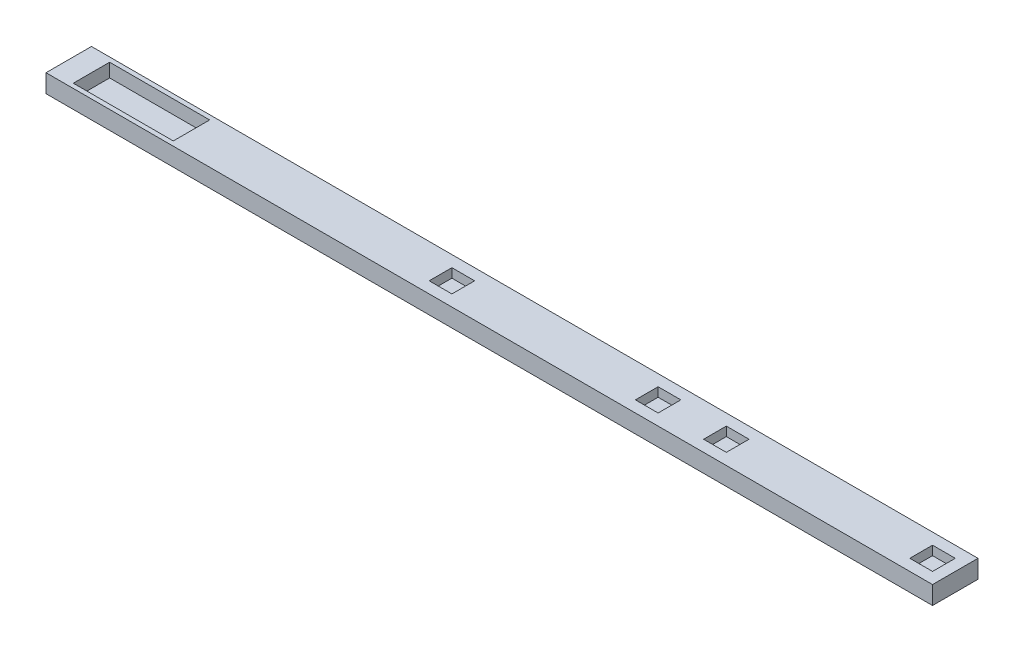
ISO-10303-21;
HEADER;
FILE_DESCRIPTION(('STEP AP214'),'2;1');
FILE_NAME('part.step','',(''),(''),'','','');
FILE_SCHEMA(('AUTOMOTIVE_DESIGN { 1 0 10303 214 1 1 1 1 }'));
ENDSEC;
DATA;
#1=APPLICATION_CONTEXT('core data for automotive mechanical design processes');
#2=APPLICATION_PROTOCOL_DEFINITION('international standard','automotive_design',2000,#1);
#3=PRODUCT_CONTEXT('',#1,'mechanical');
#4=PRODUCT('Part','Part','',(#3));
#5=PRODUCT_RELATED_PRODUCT_CATEGORY('part','',(#4));
#6=PRODUCT_DEFINITION_FORMATION('','',#4);
#7=PRODUCT_DEFINITION_CONTEXT('part definition',#1,'design');
#8=PRODUCT_DEFINITION('design','',#6,#7);
#9=PRODUCT_DEFINITION_SHAPE('','',#8);
#10=(LENGTH_UNIT() NAMED_UNIT(*) SI_UNIT(.MILLI.,.METRE.));
#11=(NAMED_UNIT(*) PLANE_ANGLE_UNIT() SI_UNIT($,.RADIAN.));
#12=(NAMED_UNIT(*) SI_UNIT($,.STERADIAN.) SOLID_ANGLE_UNIT());
#13=UNCERTAINTY_MEASURE_WITH_UNIT(LENGTH_MEASURE(1.E-05),#10,'distance_accuracy_value','');
#14=(GEOMETRIC_REPRESENTATION_CONTEXT(3) GLOBAL_UNCERTAINTY_ASSIGNED_CONTEXT((#13)) GLOBAL_UNIT_ASSIGNED_CONTEXT((#10,
#11,#12)) REPRESENTATION_CONTEXT('',''));
#15=CARTESIAN_POINT('',(0.,0.,0.));
#16=DIRECTION('',(0.,0.,1.));
#17=DIRECTION('',(1.,0.,0.));
#18=AXIS2_PLACEMENT_3D('',#15,#16,#17);
#19=CARTESIAN_POINT('',(97.5,4.,5.00000000000001));
#20=DIRECTION('',(-1.,0.,0.));
#21=DIRECTION('',(0.,0.,1.));
#22=AXIS2_PLACEMENT_3D('',#19,#20,#21);
#23=PLANE('',#22);
#24=DIRECTION('',(0.,0.,-1.));
#25=VECTOR('',#24,1.);
#26=CARTESIAN_POINT('',(97.5,0.,5.00000000000001));
#27=LINE('',#26,#25);
#28=CARTESIAN_POINT('',(97.5,0.,5.00000000000001));
#29=VERTEX_POINT('',#28);
#30=CARTESIAN_POINT('',(97.5,0.,-4.99999999999999));
#31=VERTEX_POINT('',#30);
#32=EDGE_CURVE('E357',#29,#31,#27,.T.);
#33=ORIENTED_EDGE('',*,*,#32,.T.);
#34=DIRECTION('',(0.,-1.,0.));
#35=VECTOR('',#34,1.);
#36=CARTESIAN_POINT('',(97.5,4.,-4.99999999999999));
#37=LINE('',#36,#35);
#38=CARTESIAN_POINT('',(97.5,4.,-4.99999999999999));
#39=VERTEX_POINT('',#38);
#40=EDGE_CURVE('E11',#39,#31,#37,.T.);
#41=ORIENTED_EDGE('',*,*,#40,.F.);
#42=DIRECTION('',(0.,0.,-1.));
#43=VECTOR('',#42,1.);
#44=CARTESIAN_POINT('',(97.5,4.,5.00000000000001));
#45=LINE('',#44,#43);
#46=CARTESIAN_POINT('',(97.5,4.,5.00000000000001));
#47=VERTEX_POINT('',#46);
#48=EDGE_CURVE('E364',#47,#39,#45,.T.);
#49=ORIENTED_EDGE('',*,*,#48,.F.);
#50=DIRECTION('',(0.,-1.,0.));
#51=VECTOR('',#50,1.);
#52=CARTESIAN_POINT('',(97.5,4.,5.00000000000001));
#53=LINE('',#52,#51);
#54=EDGE_CURVE('E374',#47,#29,#53,.T.);
#55=ORIENTED_EDGE('',*,*,#54,.T.);
#56=EDGE_LOOP('',(#33,#41,#49,#55));
#57=FACE_BOUND('',#56,.T.);
#58=ADVANCED_FACE('F39',(#57),#23,.F.);
#59=CARTESIAN_POINT('',(-97.5,4.,-5.00000000000001));
#60=DIRECTION('',(0.,0.,1.));
#61=DIRECTION('',(1.,0.,0.));
#62=AXIS2_PLACEMENT_3D('',#59,#60,#61);
#63=PLANE('',#62);
#64=DIRECTION('',(-1.,0.,0.));
#65=VECTOR('',#64,1.);
#66=CARTESIAN_POINT('',(-97.5,0.,-5.00000000000001));
#67=LINE('',#66,#65);
#68=CARTESIAN_POINT('',(-97.5,0.,-5.00000000000001));
#69=VERTEX_POINT('',#68);
#70=EDGE_CURVE('E377',#31,#69,#67,.T.);
#71=ORIENTED_EDGE('',*,*,#70,.T.);
#72=DIRECTION('',(0.,-1.,0.));
#73=VECTOR('',#72,1.);
#74=CARTESIAN_POINT('',(-97.5,4.,-5.00000000000001));
#75=LINE('',#74,#73);
#76=CARTESIAN_POINT('',(-97.5,4.,-5.00000000000001));
#77=VERTEX_POINT('',#76);
#78=EDGE_CURVE('E46',#77,#69,#75,.T.);
#79=ORIENTED_EDGE('',*,*,#78,.F.);
#80=DIRECTION('',(-1.,0.,0.));
#81=VECTOR('',#80,1.);
#82=CARTESIAN_POINT('',(-97.5,4.,-5.00000000000001));
#83=LINE('',#82,#81);
#84=EDGE_CURVE('E367',#39,#77,#83,.T.);
#85=ORIENTED_EDGE('',*,*,#84,.F.);
#86=ORIENTED_EDGE('',*,*,#40,.T.);
#87=EDGE_LOOP('',(#71,#79,#85,#86));
#88=FACE_BOUND('',#87,.T.);
#89=ADVANCED_FACE('F407',(#88),#63,.F.);
#90=CARTESIAN_POINT('',(-97.5,4.,5.00000000000001));
#91=DIRECTION('',(1.,0.,0.));
#92=DIRECTION('',(0.,0.,-1.));
#93=AXIS2_PLACEMENT_3D('',#90,#91,#92);
#94=PLANE('',#93);
#95=DIRECTION('',(0.,0.,1.));
#96=VECTOR('',#95,1.);
#97=CARTESIAN_POINT('',(-97.5,0.,5.00000000000001));
#98=LINE('',#97,#96);
#99=CARTESIAN_POINT('',(-97.5,0.,5.00000000000001));
#100=VERTEX_POINT('',#99);
#101=EDGE_CURVE('E379',#69,#100,#98,.T.);
#102=ORIENTED_EDGE('',*,*,#101,.T.);
#103=DIRECTION('',(0.,-1.,0.));
#104=VECTOR('',#103,1.);
#105=CARTESIAN_POINT('',(-97.5,4.,5.00000000000001));
#106=LINE('',#105,#104);
#107=CARTESIAN_POINT('',(-97.5,4.,5.00000000000001));
#108=VERTEX_POINT('',#107);
#109=EDGE_CURVE('E384',#108,#100,#106,.T.);
#110=ORIENTED_EDGE('',*,*,#109,.F.);
#111=DIRECTION('',(0.,0.,1.));
#112=VECTOR('',#111,1.);
#113=CARTESIAN_POINT('',(-97.5,4.,5.00000000000001));
#114=LINE('',#113,#112);
#115=EDGE_CURVE('E370',#77,#108,#114,.T.);
#116=ORIENTED_EDGE('',*,*,#115,.F.);
#117=ORIENTED_EDGE('',*,*,#78,.T.);
#118=EDGE_LOOP('',(#102,#110,#116,#117));
#119=FACE_BOUND('',#118,.T.);
#120=ADVANCED_FACE('F391',(#119),#94,.F.);
#121=CARTESIAN_POINT('',(-97.5,4.,5.00000000000001));
#122=DIRECTION('',(0.,0.,-1.));
#123=DIRECTION('',(-1.,0.,0.));
#124=AXIS2_PLACEMENT_3D('',#121,#122,#123);
#125=PLANE('',#124);
#126=DIRECTION('',(1.,0.,0.));
#127=VECTOR('',#126,1.);
#128=CARTESIAN_POINT('',(-97.5,0.,5.00000000000001));
#129=LINE('',#128,#127);
#130=EDGE_CURVE('E368',#100,#29,#129,.T.);
#131=ORIENTED_EDGE('',*,*,#130,.T.);
#132=ORIENTED_EDGE('',*,*,#54,.F.);
#133=DIRECTION('',(1.,0.,0.));
#134=VECTOR('',#133,1.);
#135=CARTESIAN_POINT('',(-97.5,4.,5.00000000000001));
#136=LINE('',#135,#134);
#137=EDGE_CURVE('E372',#108,#47,#136,.T.);
#138=ORIENTED_EDGE('',*,*,#137,.F.);
#139=ORIENTED_EDGE('',*,*,#109,.T.);
#140=EDGE_LOOP('',(#131,#132,#138,#139));
#141=FACE_BOUND('',#140,.T.);
#142=ADVANCED_FACE('F400',(#141),#125,.F.);
#143=CARTESIAN_POINT('',(0.,4.,0.));
#144=DIRECTION('',(0.,-1.,0.));
#145=DIRECTION('',(0.,0.,-1.));
#146=AXIS2_PLACEMENT_3D('',#143,#144,#145);
#147=PLANE('',#146);
#148=DIRECTION('',(-1.,0.,0.));
#149=VECTOR('',#148,1.);
#150=CARTESIAN_POINT('',(90.,4.,-2.5));
#151=LINE('',#150,#149);
#152=CARTESIAN_POINT('',(95.,4.,-2.5));
#153=VERTEX_POINT('',#152);
#154=CARTESIAN_POINT('',(90.,4.,-2.5));
#155=VERTEX_POINT('',#154);
#156=EDGE_CURVE('E228',#153,#155,#151,.T.);
#157=ORIENTED_EDGE('',*,*,#156,.F.);
#158=DIRECTION('',(0.,0.,-1.));
#159=VECTOR('',#158,1.);
#160=CARTESIAN_POINT('',(95.,4.,2.5));
#161=LINE('',#160,#159);
#162=CARTESIAN_POINT('',(95.,4.,2.5));
#163=VERTEX_POINT('',#162);
#164=EDGE_CURVE('E53',#163,#153,#161,.T.);
#165=ORIENTED_EDGE('',*,*,#164,.F.);
#166=DIRECTION('',(1.,0.,0.));
#167=VECTOR('',#166,1.);
#168=CARTESIAN_POINT('',(90.,4.,2.5));
#169=LINE('',#168,#167);
#170=CARTESIAN_POINT('',(90.,4.,2.5));
#171=VERTEX_POINT('',#170);
#172=EDGE_CURVE('E219',#171,#163,#169,.T.);
#173=ORIENTED_EDGE('',*,*,#172,.F.);
#174=DIRECTION('',(0.,0.,1.));
#175=VECTOR('',#174,1.);
#176=CARTESIAN_POINT('',(90.,4.,2.5));
#177=LINE('',#176,#175);
#178=EDGE_CURVE('E222',#155,#171,#177,.T.);
#179=ORIENTED_EDGE('',*,*,#178,.F.);
#180=EDGE_LOOP('',(#157,#165,#173,#179));
#181=FACE_BOUND('',#180,.T.);
#182=DIRECTION('',(0.,0.,-1.));
#183=VECTOR('',#182,1.);
#184=CARTESIAN_POINT('',(34.64,4.,2.50000000000001));
#185=LINE('',#184,#183);
#186=CARTESIAN_POINT('',(34.64,4.,2.50000000000001));
#187=VERTEX_POINT('',#186);
#188=CARTESIAN_POINT('',(34.64,4.,-2.5));
#189=VERTEX_POINT('',#188);
#190=EDGE_CURVE('E255',#187,#189,#185,.T.);
#191=ORIENTED_EDGE('',*,*,#190,.F.);
#192=DIRECTION('',(1.,0.,0.));
#193=VECTOR('',#192,1.);
#194=CARTESIAN_POINT('',(34.64,4.,2.50000000000001));
#195=LINE('',#194,#193);
#196=CARTESIAN_POINT('',(29.64,4.,2.50000000000001));
#197=VERTEX_POINT('',#196);
#198=EDGE_CURVE('E61',#197,#187,#195,.T.);
#199=ORIENTED_EDGE('',*,*,#198,.F.);
#200=DIRECTION('',(0.,0.,1.));
#201=VECTOR('',#200,1.);
#202=CARTESIAN_POINT('',(29.64,4.,2.50000000000001));
#203=LINE('',#202,#201);
#204=CARTESIAN_POINT('',(29.64,4.,-2.5));
#205=VERTEX_POINT('',#204);
#206=EDGE_CURVE('E248',#205,#197,#203,.T.);
#207=ORIENTED_EDGE('',*,*,#206,.F.);
#208=DIRECTION('',(-1.,0.,0.));
#209=VECTOR('',#208,1.);
#210=CARTESIAN_POINT('',(34.64,4.,-2.5));
#211=LINE('',#210,#209);
#212=EDGE_CURVE('E251',#189,#205,#211,.T.);
#213=ORIENTED_EDGE('',*,*,#212,.F.);
#214=EDGE_LOOP('',(#191,#199,#207,#213));
#215=FACE_BOUND('',#214,.T.);
#216=DIRECTION('',(0.,0.,-1.));
#217=VECTOR('',#216,1.);
#218=CARTESIAN_POINT('',(-10.72,4.,2.5));
#219=LINE('',#218,#217);
#220=CARTESIAN_POINT('',(-10.72,4.,2.5));
#221=VERTEX_POINT('',#220);
#222=CARTESIAN_POINT('',(-10.72,4.,-2.5));
#223=VERTEX_POINT('',#222);
#224=EDGE_CURVE('E318',#221,#223,#219,.T.);
#225=ORIENTED_EDGE('',*,*,#224,.F.);
#226=DIRECTION('',(1.,0.,0.));
#227=VECTOR('',#226,1.);
#228=CARTESIAN_POINT('',(-10.72,4.,2.5));
#229=LINE('',#228,#227);
#230=CARTESIAN_POINT('',(-15.72,4.,2.5));
#231=VERTEX_POINT('',#230);
#232=EDGE_CURVE('E280',#231,#221,#229,.T.);
#233=ORIENTED_EDGE('',*,*,#232,.F.);
#234=DIRECTION('',(0.,0.,1.));
#235=VECTOR('',#234,1.);
#236=CARTESIAN_POINT('',(-15.72,4.,2.5));
#237=LINE('',#236,#235);
#238=CARTESIAN_POINT('',(-15.72,4.,-2.5));
#239=VERTEX_POINT('',#238);
#240=EDGE_CURVE('E311',#239,#231,#237,.T.);
#241=ORIENTED_EDGE('',*,*,#240,.F.);
#242=DIRECTION('',(-1.,0.,0.));
#243=VECTOR('',#242,1.);
#244=CARTESIAN_POINT('',(-10.72,4.,-2.5));
#245=LINE('',#244,#243);
#246=EDGE_CURVE('E314',#223,#239,#245,.T.);
#247=ORIENTED_EDGE('',*,*,#246,.F.);
#248=EDGE_LOOP('',(#225,#233,#241,#247));
#249=FACE_BOUND('',#248,.T.);
#250=DIRECTION('',(-1.,0.,0.));
#251=VECTOR('',#250,1.);
#252=CARTESIAN_POINT('',(44.64,4.,-2.5));
#253=LINE('',#252,#251);
#254=CARTESIAN_POINT('',(49.64,4.,-2.5));
#255=VERTEX_POINT('',#254);
#256=CARTESIAN_POINT('',(44.64,4.,-2.5));
#257=VERTEX_POINT('',#256);
#258=EDGE_CURVE('E288',#255,#257,#253,.T.);
#259=ORIENTED_EDGE('',*,*,#258,.F.);
#260=DIRECTION('',(0.,0.,-1.));
#261=VECTOR('',#260,1.);
#262=CARTESIAN_POINT('',(49.64,4.,2.50000000000001));
#263=LINE('',#262,#261);
#264=CARTESIAN_POINT('',(49.64,4.,2.50000000000001));
#265=VERTEX_POINT('',#264);
#266=EDGE_CURVE('E229',#265,#255,#263,.T.);
#267=ORIENTED_EDGE('',*,*,#266,.F.);
#268=DIRECTION('',(1.,0.,0.));
#269=VECTOR('',#268,1.);
#270=CARTESIAN_POINT('',(44.64,4.,2.50000000000001));
#271=LINE('',#270,#269);
#272=CARTESIAN_POINT('',(44.64,4.,2.50000000000001));
#273=VERTEX_POINT('',#272);
#274=EDGE_CURVE('E281',#273,#265,#271,.T.);
#275=ORIENTED_EDGE('',*,*,#274,.F.);
#276=DIRECTION('',(0.,0.,1.));
#277=VECTOR('',#276,1.);
#278=CARTESIAN_POINT('',(44.64,4.,2.50000000000001));
#279=LINE('',#278,#277);
#280=EDGE_CURVE('E284',#257,#273,#279,.T.);
#281=ORIENTED_EDGE('',*,*,#280,.F.);
#282=EDGE_LOOP('',(#259,#267,#275,#281));
#283=FACE_BOUND('',#282,.T.);
#284=DIRECTION('',(0.,0.,-1.));
#285=VECTOR('',#284,1.);
#286=CARTESIAN_POINT('',(-70.5,4.,3.99999999999999));
#287=LINE('',#286,#285);
#288=CARTESIAN_POINT('',(-70.5,4.,3.99999999999999));
#289=VERTEX_POINT('',#288);
#290=CARTESIAN_POINT('',(-70.5,4.,-4.00000000000001));
#291=VERTEX_POINT('',#290);
#292=EDGE_CURVE('E347',#289,#291,#287,.T.);
#293=ORIENTED_EDGE('',*,*,#292,.F.);
#294=DIRECTION('',(1.,0.,0.));
#295=VECTOR('',#294,1.);
#296=CARTESIAN_POINT('',(-92.5,4.,4.00000000000001));
#297=LINE('',#296,#295);
#298=CARTESIAN_POINT('',(-92.5,4.,4.00000000000001));
#299=VERTEX_POINT('',#298);
#300=EDGE_CURVE('E235',#299,#289,#297,.T.);
#301=ORIENTED_EDGE('',*,*,#300,.F.);
#302=DIRECTION('',(0.,0.,1.));
#303=VECTOR('',#302,1.);
#304=CARTESIAN_POINT('',(-92.5,4.,4.00000000000001));
#305=LINE('',#304,#303);
#306=CARTESIAN_POINT('',(-92.5,4.,-3.99999999999999));
#307=VERTEX_POINT('',#306);
#308=EDGE_CURVE('E336',#307,#299,#305,.T.);
#309=ORIENTED_EDGE('',*,*,#308,.F.);
#310=DIRECTION('',(-1.,0.,0.));
#311=VECTOR('',#310,1.);
#312=CARTESIAN_POINT('',(-92.5,4.,-3.99999999999999));
#313=LINE('',#312,#311);
#314=EDGE_CURVE('E350',#291,#307,#313,.T.);
#315=ORIENTED_EDGE('',*,*,#314,.F.);
#316=EDGE_LOOP('',(#293,#301,#309,#315));
#317=FACE_BOUND('',#316,.T.);
#318=ORIENTED_EDGE('',*,*,#48,.T.);
#319=ORIENTED_EDGE('',*,*,#84,.T.);
#320=ORIENTED_EDGE('',*,*,#115,.T.);
#321=ORIENTED_EDGE('',*,*,#137,.T.);
#322=EDGE_LOOP('',(#318,#319,#320,#321));
#323=FACE_BOUND('',#322,.T.);
#324=ADVANCED_FACE('F406',(#181,#215,#249,#283,#317,#323),#147,.F.);
#325=CARTESIAN_POINT('',(0.,0.,0.));
#326=DIRECTION('',(0.,-1.,0.));
#327=DIRECTION('',(0.,0.,-1.));
#328=AXIS2_PLACEMENT_3D('',#325,#326,#327);
#329=PLANE('',#328);
#330=ORIENTED_EDGE('',*,*,#32,.F.);
#331=ORIENTED_EDGE('',*,*,#130,.F.);
#332=ORIENTED_EDGE('',*,*,#101,.F.);
#333=ORIENTED_EDGE('',*,*,#70,.F.);
#334=EDGE_LOOP('',(#330,#331,#332,#333));
#335=FACE_BOUND('',#334,.T.);
#336=ADVANCED_FACE('F397',(#335),#329,.T.);
#337=CARTESIAN_POINT('',(-92.5,1.,4.00000000000001));
#338=DIRECTION('',(0.,0.,1.));
#339=DIRECTION('',(1.,0.,0.));
#340=AXIS2_PLACEMENT_3D('',#337,#338,#339);
#341=PLANE('',#340);
#342=ORIENTED_EDGE('',*,*,#300,.T.);
#343=DIRECTION('',(0.,1.,0.));
#344=VECTOR('',#343,1.);
#345=CARTESIAN_POINT('',(-70.5,1.,3.99999999999999));
#346=LINE('',#345,#344);
#347=CARTESIAN_POINT('',(-70.5,1.,3.99999999999999));
#348=VERTEX_POINT('',#347);
#349=EDGE_CURVE('E345',#348,#289,#346,.T.);
#350=ORIENTED_EDGE('',*,*,#349,.F.);
#351=DIRECTION('',(1.,0.,0.));
#352=VECTOR('',#351,1.);
#353=CARTESIAN_POINT('',(-92.5,1.,4.00000000000001));
#354=LINE('',#353,#352);
#355=CARTESIAN_POINT('',(-92.5,1.,4.00000000000001));
#356=VERTEX_POINT('',#355);
#357=EDGE_CURVE('E332',#356,#348,#354,.T.);
#358=ORIENTED_EDGE('',*,*,#357,.F.);
#359=DIRECTION('',(0.,1.,0.));
#360=VECTOR('',#359,1.);
#361=CARTESIAN_POINT('',(-92.5,1.,4.00000000000001));
#362=LINE('',#361,#360);
#363=EDGE_CURVE('E355',#356,#299,#362,.T.);
#364=ORIENTED_EDGE('',*,*,#363,.T.);
#365=EDGE_LOOP('',(#342,#350,#358,#364));
#366=FACE_BOUND('',#365,.T.);
#367=ADVANCED_FACE('F419',(#366),#341,.F.);
#368=CARTESIAN_POINT('',(-92.5,1.,4.00000000000001));
#369=DIRECTION('',(-1.,0.,0.));
#370=DIRECTION('',(0.,0.,1.));
#371=AXIS2_PLACEMENT_3D('',#368,#369,#370);
#372=PLANE('',#371);
#373=ORIENTED_EDGE('',*,*,#308,.T.);
#374=ORIENTED_EDGE('',*,*,#363,.F.);
#375=DIRECTION('',(0.,0.,1.));
#376=VECTOR('',#375,1.);
#377=CARTESIAN_POINT('',(-92.5,1.,4.00000000000001));
#378=LINE('',#377,#376);
#379=CARTESIAN_POINT('',(-92.5,1.,-3.99999999999999));
#380=VERTEX_POINT('',#379);
#381=EDGE_CURVE('E342',#380,#356,#378,.T.);
#382=ORIENTED_EDGE('',*,*,#381,.F.);
#383=DIRECTION('',(0.,1.,0.));
#384=VECTOR('',#383,1.);
#385=CARTESIAN_POINT('',(-92.5,1.,-3.99999999999999));
#386=LINE('',#385,#384);
#387=EDGE_CURVE('E358',#380,#307,#386,.T.);
#388=ORIENTED_EDGE('',*,*,#387,.T.);
#389=EDGE_LOOP('',(#373,#374,#382,#388));
#390=FACE_BOUND('',#389,.T.);
#391=ADVANCED_FACE('F425',(#390),#372,.F.);
#392=CARTESIAN_POINT('',(-92.5,1.,-3.99999999999999));
#393=DIRECTION('',(0.,0.,-1.));
#394=DIRECTION('',(-1.,0.,0.));
#395=AXIS2_PLACEMENT_3D('',#392,#393,#394);
#396=PLANE('',#395);
#397=ORIENTED_EDGE('',*,*,#314,.T.);
#398=ORIENTED_EDGE('',*,*,#387,.F.);
#399=DIRECTION('',(-1.,0.,0.));
#400=VECTOR('',#399,1.);
#401=CARTESIAN_POINT('',(-92.5,1.,-3.99999999999999));
#402=LINE('',#401,#400);
#403=CARTESIAN_POINT('',(-70.5,1.,-4.00000000000001));
#404=VERTEX_POINT('',#403);
#405=EDGE_CURVE('E339',#404,#380,#402,.T.);
#406=ORIENTED_EDGE('',*,*,#405,.F.);
#407=DIRECTION('',(0.,1.,0.));
#408=VECTOR('',#407,1.);
#409=CARTESIAN_POINT('',(-70.5,1.,-4.00000000000001));
#410=LINE('',#409,#408);
#411=EDGE_CURVE('E360',#404,#291,#410,.T.);
#412=ORIENTED_EDGE('',*,*,#411,.T.);
#413=EDGE_LOOP('',(#397,#398,#406,#412));
#414=FACE_BOUND('',#413,.T.);
#415=ADVANCED_FACE('F431',(#414),#396,.F.);
#416=CARTESIAN_POINT('',(-70.5,1.,3.99999999999999));
#417=DIRECTION('',(1.,0.,0.));
#418=DIRECTION('',(0.,0.,-1.));
#419=AXIS2_PLACEMENT_3D('',#416,#417,#418);
#420=PLANE('',#419);
#421=ORIENTED_EDGE('',*,*,#292,.T.);
#422=ORIENTED_EDGE('',*,*,#411,.F.);
#423=DIRECTION('',(0.,0.,-1.));
#424=VECTOR('',#423,1.);
#425=CARTESIAN_POINT('',(-70.5,1.,3.99999999999999));
#426=LINE('',#425,#424);
#427=EDGE_CURVE('E335',#348,#404,#426,.T.);
#428=ORIENTED_EDGE('',*,*,#427,.F.);
#429=ORIENTED_EDGE('',*,*,#349,.T.);
#430=EDGE_LOOP('',(#421,#422,#428,#429));
#431=FACE_BOUND('',#430,.T.);
#432=ADVANCED_FACE('F427',(#431),#420,.F.);
#433=CARTESIAN_POINT('',(0.,1.,0.));
#434=DIRECTION('',(0.,1.,0.));
#435=DIRECTION('',(0.,0.,1.));
#436=AXIS2_PLACEMENT_3D('',#433,#434,#435);
#437=PLANE('',#436);
#438=ORIENTED_EDGE('',*,*,#357,.T.);
#439=ORIENTED_EDGE('',*,*,#427,.T.);
#440=ORIENTED_EDGE('',*,*,#405,.T.);
#441=ORIENTED_EDGE('',*,*,#381,.T.);
#442=EDGE_LOOP('',(#438,#439,#440,#441));
#443=FACE_BOUND('',#442,.T.);
#444=ADVANCED_FACE('F430',(#443),#437,.T.);
#445=CARTESIAN_POINT('',(49.64,2.,2.50000000000001));
#446=DIRECTION('',(1.,0.,0.));
#447=DIRECTION('',(0.,0.,-1.));
#448=AXIS2_PLACEMENT_3D('',#445,#446,#447);
#449=PLANE('',#448);
#450=ORIENTED_EDGE('',*,*,#266,.T.);
#451=DIRECTION('',(0.,1.,0.));
#452=VECTOR('',#451,1.);
#453=CARTESIAN_POINT('',(49.64,2.,-2.5));
#454=LINE('',#453,#452);
#455=CARTESIAN_POINT('',(49.64,2.,-2.5));
#456=VERTEX_POINT('',#455);
#457=EDGE_CURVE('E270',#456,#255,#454,.T.);
#458=ORIENTED_EDGE('',*,*,#457,.F.);
#459=DIRECTION('',(0.,0.,-1.));
#460=VECTOR('',#459,1.);
#461=CARTESIAN_POINT('',(49.64,2.,2.50000000000001));
#462=LINE('',#461,#460);
#463=CARTESIAN_POINT('',(49.64,2.,2.50000000000001));
#464=VERTEX_POINT('',#463);
#465=EDGE_CURVE('E285',#464,#456,#462,.T.);
#466=ORIENTED_EDGE('',*,*,#465,.F.);
#467=DIRECTION('',(0.,1.,0.));
#468=VECTOR('',#467,1.);
#469=CARTESIAN_POINT('',(49.64,2.,2.50000000000001));
#470=LINE('',#469,#468);
#471=EDGE_CURVE('E278',#464,#265,#470,.T.);
#472=ORIENTED_EDGE('',*,*,#471,.T.);
#473=EDGE_LOOP('',(#450,#458,#466,#472));
#474=FACE_BOUND('',#473,.T.);
#475=ADVANCED_FACE('F441',(#474),#449,.F.);
#476=CARTESIAN_POINT('',(44.64,2.,2.50000000000001));
#477=DIRECTION('',(0.,0.,1.));
#478=DIRECTION('',(1.,0.,0.));
#479=AXIS2_PLACEMENT_3D('',#476,#477,#478);
#480=PLANE('',#479);
#481=ORIENTED_EDGE('',*,*,#274,.T.);
#482=ORIENTED_EDGE('',*,*,#471,.F.);
#483=DIRECTION('',(1.,0.,0.));
#484=VECTOR('',#483,1.);
#485=CARTESIAN_POINT('',(44.64,2.,2.50000000000001));
#486=LINE('',#485,#484);
#487=CARTESIAN_POINT('',(44.64,2.,2.50000000000001));
#488=VERTEX_POINT('',#487);
#489=EDGE_CURVE('E273',#488,#464,#486,.T.);
#490=ORIENTED_EDGE('',*,*,#489,.F.);
#491=DIRECTION('',(0.,1.,0.));
#492=VECTOR('',#491,1.);
#493=CARTESIAN_POINT('',(44.64,2.,2.50000000000001));
#494=LINE('',#493,#492);
#495=EDGE_CURVE('E276',#488,#273,#494,.T.);
#496=ORIENTED_EDGE('',*,*,#495,.T.);
#497=EDGE_LOOP('',(#481,#482,#490,#496));
#498=FACE_BOUND('',#497,.T.);
#499=ADVANCED_FACE('F469',(#498),#480,.F.);
#500=CARTESIAN_POINT('',(44.64,2.,2.50000000000001));
#501=DIRECTION('',(-1.,0.,0.));
#502=DIRECTION('',(0.,0.,1.));
#503=AXIS2_PLACEMENT_3D('',#500,#501,#502);
#504=PLANE('',#503);
#505=ORIENTED_EDGE('',*,*,#280,.T.);
#506=ORIENTED_EDGE('',*,*,#495,.F.);
#507=DIRECTION('',(0.,0.,1.));
#508=VECTOR('',#507,1.);
#509=CARTESIAN_POINT('',(44.64,2.,2.50000000000001));
#510=LINE('',#509,#508);
#511=CARTESIAN_POINT('',(44.64,2.,-2.5));
#512=VERTEX_POINT('',#511);
#513=EDGE_CURVE('E294',#512,#488,#510,.T.);
#514=ORIENTED_EDGE('',*,*,#513,.F.);
#515=DIRECTION('',(0.,1.,0.));
#516=VECTOR('',#515,1.);
#517=CARTESIAN_POINT('',(44.64,2.,-2.5));
#518=LINE('',#517,#516);
#519=EDGE_CURVE('E274',#512,#257,#518,.T.);
#520=ORIENTED_EDGE('',*,*,#519,.T.);
#521=EDGE_LOOP('',(#505,#506,#514,#520));
#522=FACE_BOUND('',#521,.T.);
#523=ADVANCED_FACE('F472',(#522),#504,.F.);
#524=CARTESIAN_POINT('',(44.64,2.,-2.5));
#525=DIRECTION('',(0.,0.,-1.));
#526=DIRECTION('',(-1.,0.,0.));
#527=AXIS2_PLACEMENT_3D('',#524,#525,#526);
#528=PLANE('',#527);
#529=ORIENTED_EDGE('',*,*,#258,.T.);
#530=ORIENTED_EDGE('',*,*,#519,.F.);
#531=DIRECTION('',(-1.,0.,0.));
#532=VECTOR('',#531,1.);
#533=CARTESIAN_POINT('',(44.64,2.,-2.5));
#534=LINE('',#533,#532);
#535=EDGE_CURVE('E297',#456,#512,#534,.T.);
#536=ORIENTED_EDGE('',*,*,#535,.F.);
#537=ORIENTED_EDGE('',*,*,#457,.T.);
#538=EDGE_LOOP('',(#529,#530,#536,#537));
#539=FACE_BOUND('',#538,.T.);
#540=ADVANCED_FACE('F467',(#539),#528,.F.);
#541=CARTESIAN_POINT('',(0.,2.,0.));
#542=DIRECTION('',(0.,-1.,0.));
#543=DIRECTION('',(0.,0.,-1.));
#544=AXIS2_PLACEMENT_3D('',#541,#542,#543);
#545=PLANE('',#544);
#546=ORIENTED_EDGE('',*,*,#465,.T.);
#547=ORIENTED_EDGE('',*,*,#535,.T.);
#548=ORIENTED_EDGE('',*,*,#513,.T.);
#549=ORIENTED_EDGE('',*,*,#489,.T.);
#550=EDGE_LOOP('',(#546,#547,#548,#549));
#551=FACE_BOUND('',#550,.T.);
#552=ADVANCED_FACE('F463',(#551),#545,.F.);
#553=CARTESIAN_POINT('',(-10.72,2.,2.5));
#554=DIRECTION('',(0.,0.,1.));
#555=DIRECTION('',(1.,0.,0.));
#556=AXIS2_PLACEMENT_3D('',#553,#554,#555);
#557=PLANE('',#556);
#558=ORIENTED_EDGE('',*,*,#232,.T.);
#559=DIRECTION('',(0.,1.,0.));
#560=VECTOR('',#559,1.);
#561=CARTESIAN_POINT('',(-10.72,2.,2.5));
#562=LINE('',#561,#560);
#563=CARTESIAN_POINT('',(-10.72,2.,2.5));
#564=VERTEX_POINT('',#563);
#565=EDGE_CURVE('E302',#564,#221,#562,.T.);
#566=ORIENTED_EDGE('',*,*,#565,.F.);
#567=DIRECTION('',(1.,0.,0.));
#568=VECTOR('',#567,1.);
#569=CARTESIAN_POINT('',(-10.72,2.,2.5));
#570=LINE('',#569,#568);
#571=CARTESIAN_POINT('',(-15.72,2.,2.5));
#572=VERTEX_POINT('',#571);
#573=EDGE_CURVE('E315',#572,#564,#570,.T.);
#574=ORIENTED_EDGE('',*,*,#573,.F.);
#575=DIRECTION('',(0.,1.,0.));
#576=VECTOR('',#575,1.);
#577=CARTESIAN_POINT('',(-15.72,2.,2.5));
#578=LINE('',#577,#576);
#579=EDGE_CURVE('E259',#572,#231,#578,.T.);
#580=ORIENTED_EDGE('',*,*,#579,.T.);
#581=EDGE_LOOP('',(#558,#566,#574,#580));
#582=FACE_BOUND('',#581,.T.);
#583=ADVANCED_FACE('F453',(#582),#557,.F.);
#584=CARTESIAN_POINT('',(-15.72,2.,2.5));
#585=DIRECTION('',(-1.,0.,0.));
#586=DIRECTION('',(0.,0.,1.));
#587=AXIS2_PLACEMENT_3D('',#584,#585,#586);
#588=PLANE('',#587);
#589=ORIENTED_EDGE('',*,*,#240,.T.);
#590=ORIENTED_EDGE('',*,*,#579,.F.);
#591=DIRECTION('',(0.,0.,1.));
#592=VECTOR('',#591,1.);
#593=CARTESIAN_POINT('',(-15.72,2.,2.5));
#594=LINE('',#593,#592);
#595=CARTESIAN_POINT('',(-15.72,2.,-2.5));
#596=VERTEX_POINT('',#595);
#597=EDGE_CURVE('E305',#596,#572,#594,.T.);
#598=ORIENTED_EDGE('',*,*,#597,.F.);
#599=DIRECTION('',(0.,1.,0.));
#600=VECTOR('',#599,1.);
#601=CARTESIAN_POINT('',(-15.72,2.,-2.5));
#602=LINE('',#601,#600);
#603=EDGE_CURVE('E308',#596,#239,#602,.T.);
#604=ORIENTED_EDGE('',*,*,#603,.T.);
#605=EDGE_LOOP('',(#589,#590,#598,#604));
#606=FACE_BOUND('',#605,.T.);
#607=ADVANCED_FACE('F449',(#606),#588,.F.);
#608=CARTESIAN_POINT('',(-10.72,2.,-2.5));
#609=DIRECTION('',(0.,0.,-1.));
#610=DIRECTION('',(-1.,0.,0.));
#611=AXIS2_PLACEMENT_3D('',#608,#609,#610);
#612=PLANE('',#611);
#613=ORIENTED_EDGE('',*,*,#246,.T.);
#614=ORIENTED_EDGE('',*,*,#603,.F.);
#615=DIRECTION('',(-1.,0.,0.));
#616=VECTOR('',#615,1.);
#617=CARTESIAN_POINT('',(-10.72,2.,-2.5));
#618=LINE('',#617,#616);
#619=CARTESIAN_POINT('',(-10.72,2.,-2.5));
#620=VERTEX_POINT('',#619);
#621=EDGE_CURVE('E324',#620,#596,#618,.T.);
#622=ORIENTED_EDGE('',*,*,#621,.F.);
#623=DIRECTION('',(0.,1.,0.));
#624=VECTOR('',#623,1.);
#625=CARTESIAN_POINT('',(-10.72,2.,-2.5));
#626=LINE('',#625,#624);
#627=EDGE_CURVE('E306',#620,#223,#626,.T.);
#628=ORIENTED_EDGE('',*,*,#627,.T.);
#629=EDGE_LOOP('',(#613,#614,#622,#628));
#630=FACE_BOUND('',#629,.T.);
#631=ADVANCED_FACE('F452',(#630),#612,.F.);
#632=CARTESIAN_POINT('',(-10.72,2.,2.5));
#633=DIRECTION('',(1.,0.,0.));
#634=DIRECTION('',(0.,0.,-1.));
#635=AXIS2_PLACEMENT_3D('',#632,#633,#634);
#636=PLANE('',#635);
#637=ORIENTED_EDGE('',*,*,#224,.T.);
#638=ORIENTED_EDGE('',*,*,#627,.F.);
#639=DIRECTION('',(0.,0.,-1.));
#640=VECTOR('',#639,1.);
#641=CARTESIAN_POINT('',(-10.72,2.,2.5));
#642=LINE('',#641,#640);
#643=EDGE_CURVE('E327',#564,#620,#642,.T.);
#644=ORIENTED_EDGE('',*,*,#643,.F.);
#645=ORIENTED_EDGE('',*,*,#565,.T.);
#646=EDGE_LOOP('',(#637,#638,#644,#645));
#647=FACE_BOUND('',#646,.T.);
#648=ADVANCED_FACE('F447',(#647),#636,.F.);
#649=CARTESIAN_POINT('',(0.,2.,0.));
#650=DIRECTION('',(0.,-1.,0.));
#651=DIRECTION('',(0.,0.,-1.));
#652=AXIS2_PLACEMENT_3D('',#649,#650,#651);
#653=PLANE('',#652);
#654=ORIENTED_EDGE('',*,*,#573,.T.);
#655=ORIENTED_EDGE('',*,*,#643,.T.);
#656=ORIENTED_EDGE('',*,*,#621,.T.);
#657=ORIENTED_EDGE('',*,*,#597,.T.);
#658=EDGE_LOOP('',(#654,#655,#656,#657));
#659=FACE_BOUND('',#658,.T.);
#660=ADVANCED_FACE('F443',(#659),#653,.F.);
#661=CARTESIAN_POINT('',(34.64,2.,2.50000000000001));
#662=DIRECTION('',(0.,0.,1.));
#663=DIRECTION('',(1.,0.,0.));
#664=AXIS2_PLACEMENT_3D('',#661,#662,#663);
#665=PLANE('',#664);
#666=ORIENTED_EDGE('',*,*,#198,.T.);
#667=DIRECTION('',(0.,1.,0.));
#668=VECTOR('',#667,1.);
#669=CARTESIAN_POINT('',(34.64,2.,2.50000000000001));
#670=LINE('',#669,#668);
#671=CARTESIAN_POINT('',(34.64,2.,2.50000000000001));
#672=VERTEX_POINT('',#671);
#673=EDGE_CURVE('E239',#672,#187,#670,.T.);
#674=ORIENTED_EDGE('',*,*,#673,.F.);
#675=DIRECTION('',(1.,0.,0.));
#676=VECTOR('',#675,1.);
#677=CARTESIAN_POINT('',(34.64,2.,2.50000000000001));
#678=LINE('',#677,#676);
#679=CARTESIAN_POINT('',(29.64,2.,2.50000000000001));
#680=VERTEX_POINT('',#679);
#681=EDGE_CURVE('E252',#680,#672,#678,.T.);
#682=ORIENTED_EDGE('',*,*,#681,.F.);
#683=DIRECTION('',(0.,1.,0.));
#684=VECTOR('',#683,1.);
#685=CARTESIAN_POINT('',(29.64,2.,2.50000000000001));
#686=LINE('',#685,#684);
#687=EDGE_CURVE('E246',#680,#197,#686,.T.);
#688=ORIENTED_EDGE('',*,*,#687,.T.);
#689=EDGE_LOOP('',(#666,#674,#682,#688));
#690=FACE_BOUND('',#689,.T.);
#691=ADVANCED_FACE('F446',(#690),#665,.F.);
#692=CARTESIAN_POINT('',(29.64,2.,2.50000000000001));
#693=DIRECTION('',(-1.,0.,0.));
#694=DIRECTION('',(0.,0.,1.));
#695=AXIS2_PLACEMENT_3D('',#692,#693,#694);
#696=PLANE('',#695);
#697=ORIENTED_EDGE('',*,*,#206,.T.);
#698=ORIENTED_EDGE('',*,*,#687,.F.);
#699=DIRECTION('',(0.,0.,1.));
#700=VECTOR('',#699,1.);
#701=CARTESIAN_POINT('',(29.64,2.,2.50000000000001));
#702=LINE('',#701,#700);
#703=CARTESIAN_POINT('',(29.64,2.,-2.5));
#704=VERTEX_POINT('',#703);
#705=EDGE_CURVE('E241',#704,#680,#702,.T.);
#706=ORIENTED_EDGE('',*,*,#705,.F.);
#707=DIRECTION('',(0.,1.,0.));
#708=VECTOR('',#707,1.);
#709=CARTESIAN_POINT('',(29.64,2.,-2.5));
#710=LINE('',#709,#708);
#711=EDGE_CURVE('E244',#704,#205,#710,.T.);
#712=ORIENTED_EDGE('',*,*,#711,.T.);
#713=EDGE_LOOP('',(#697,#698,#706,#712));
#714=FACE_BOUND('',#713,.T.);
#715=ADVANCED_FACE('F488',(#714),#696,.F.);
#716=CARTESIAN_POINT('',(34.64,2.,-2.5));
#717=DIRECTION('',(0.,0.,-1.));
#718=DIRECTION('',(-1.,0.,0.));
#719=AXIS2_PLACEMENT_3D('',#716,#717,#718);
#720=PLANE('',#719);
#721=ORIENTED_EDGE('',*,*,#212,.T.);
#722=ORIENTED_EDGE('',*,*,#711,.F.);
#723=DIRECTION('',(-1.,0.,0.));
#724=VECTOR('',#723,1.);
#725=CARTESIAN_POINT('',(34.64,2.,-2.5));
#726=LINE('',#725,#724);
#727=CARTESIAN_POINT('',(34.64,2.,-2.5));
#728=VERTEX_POINT('',#727);
#729=EDGE_CURVE('E262',#728,#704,#726,.T.);
#730=ORIENTED_EDGE('',*,*,#729,.F.);
#731=DIRECTION('',(0.,1.,0.));
#732=VECTOR('',#731,1.);
#733=CARTESIAN_POINT('',(34.64,2.,-2.5));
#734=LINE('',#733,#732);
#735=EDGE_CURVE('E242',#728,#189,#734,.T.);
#736=ORIENTED_EDGE('',*,*,#735,.T.);
#737=EDGE_LOOP('',(#721,#722,#730,#736));
#738=FACE_BOUND('',#737,.T.);
#739=ADVANCED_FACE('F491',(#738),#720,.F.);
#740=CARTESIAN_POINT('',(34.64,2.,2.50000000000001));
#741=DIRECTION('',(1.,0.,0.));
#742=DIRECTION('',(0.,0.,-1.));
#743=AXIS2_PLACEMENT_3D('',#740,#741,#742);
#744=PLANE('',#743);
#745=ORIENTED_EDGE('',*,*,#190,.T.);
#746=ORIENTED_EDGE('',*,*,#735,.F.);
#747=DIRECTION('',(0.,0.,-1.));
#748=VECTOR('',#747,1.);
#749=CARTESIAN_POINT('',(34.64,2.,2.50000000000001));
#750=LINE('',#749,#748);
#751=EDGE_CURVE('E265',#672,#728,#750,.T.);
#752=ORIENTED_EDGE('',*,*,#751,.F.);
#753=ORIENTED_EDGE('',*,*,#673,.T.);
#754=EDGE_LOOP('',(#745,#746,#752,#753));
#755=FACE_BOUND('',#754,.T.);
#756=ADVANCED_FACE('F486',(#755),#744,.F.);
#757=CARTESIAN_POINT('',(0.,2.,0.));
#758=DIRECTION('',(0.,-1.,0.));
#759=DIRECTION('',(0.,0.,-1.));
#760=AXIS2_PLACEMENT_3D('',#757,#758,#759);
#761=PLANE('',#760);
#762=ORIENTED_EDGE('',*,*,#681,.T.);
#763=ORIENTED_EDGE('',*,*,#751,.T.);
#764=ORIENTED_EDGE('',*,*,#729,.T.);
#765=ORIENTED_EDGE('',*,*,#705,.T.);
#766=EDGE_LOOP('',(#762,#763,#764,#765));
#767=FACE_BOUND('',#766,.T.);
#768=ADVANCED_FACE('F483',(#767),#761,.F.);
#769=CARTESIAN_POINT('',(95.,2.,2.5));
#770=DIRECTION('',(1.,0.,0.));
#771=DIRECTION('',(0.,0.,-1.));
#772=AXIS2_PLACEMENT_3D('',#769,#770,#771);
#773=PLANE('',#772);
#774=ORIENTED_EDGE('',*,*,#164,.T.);
#775=DIRECTION('',(0.,1.,0.));
#776=VECTOR('',#775,1.);
#777=CARTESIAN_POINT('',(95.,2.,-2.5));
#778=LINE('',#777,#776);
#779=CARTESIAN_POINT('',(95.,2.,-2.5));
#780=VERTEX_POINT('',#779);
#781=EDGE_CURVE('E197',#780,#153,#778,.T.);
#782=ORIENTED_EDGE('',*,*,#781,.F.);
#783=DIRECTION('',(0.,0.,-1.));
#784=VECTOR('',#783,1.);
#785=CARTESIAN_POINT('',(95.,2.,2.5));
#786=LINE('',#785,#784);
#787=CARTESIAN_POINT('',(95.,2.,2.5));
#788=VERTEX_POINT('',#787);
#789=EDGE_CURVE('E201',#788,#780,#786,.T.);
#790=ORIENTED_EDGE('',*,*,#789,.F.);
#791=DIRECTION('',(0.,1.,0.));
#792=VECTOR('',#791,1.);
#793=CARTESIAN_POINT('',(95.,2.,2.5));
#794=LINE('',#793,#792);
#795=EDGE_CURVE('E233',#788,#163,#794,.T.);
#796=ORIENTED_EDGE('',*,*,#795,.T.);
#797=EDGE_LOOP('',(#774,#782,#790,#796));
#798=FACE_BOUND('',#797,.T.);
#799=ADVANCED_FACE('F199',(#798),#773,.F.);
#800=CARTESIAN_POINT('',(90.,2.,2.5));
#801=DIRECTION('',(0.,0.,1.));
#802=DIRECTION('',(1.,0.,0.));
#803=AXIS2_PLACEMENT_3D('',#800,#801,#802);
#804=PLANE('',#803);
#805=ORIENTED_EDGE('',*,*,#172,.T.);
#806=ORIENTED_EDGE('',*,*,#795,.F.);
#807=DIRECTION('',(1.,0.,0.));
#808=VECTOR('',#807,1.);
#809=CARTESIAN_POINT('',(90.,2.,2.5));
#810=LINE('',#809,#808);
#811=CARTESIAN_POINT('',(90.,2.,2.5));
#812=VERTEX_POINT('',#811);
#813=EDGE_CURVE('E207',#812,#788,#810,.T.);
#814=ORIENTED_EDGE('',*,*,#813,.F.);
#815=DIRECTION('',(0.,1.,0.));
#816=VECTOR('',#815,1.);
#817=CARTESIAN_POINT('',(90.,2.,2.5));
#818=LINE('',#817,#816);
#819=EDGE_CURVE('E236',#812,#171,#818,.T.);
#820=ORIENTED_EDGE('',*,*,#819,.T.);
#821=EDGE_LOOP('',(#805,#806,#814,#820));
#822=FACE_BOUND('',#821,.T.);
#823=ADVANCED_FACE('F503',(#822),#804,.F.);
#824=CARTESIAN_POINT('',(90.,2.,2.5));
#825=DIRECTION('',(-1.,0.,0.));
#826=DIRECTION('',(0.,0.,1.));
#827=AXIS2_PLACEMENT_3D('',#824,#825,#826);
#828=PLANE('',#827);
#829=ORIENTED_EDGE('',*,*,#178,.T.);
#830=ORIENTED_EDGE('',*,*,#819,.F.);
#831=DIRECTION('',(0.,0.,1.));
#832=VECTOR('',#831,1.);
#833=CARTESIAN_POINT('',(90.,2.,2.5));
#834=LINE('',#833,#832);
#835=CARTESIAN_POINT('',(90.,2.,-2.5));
#836=VERTEX_POINT('',#835);
#837=EDGE_CURVE('E215',#836,#812,#834,.T.);
#838=ORIENTED_EDGE('',*,*,#837,.F.);
#839=DIRECTION('',(0.,1.,0.));
#840=VECTOR('',#839,1.);
#841=CARTESIAN_POINT('',(90.,2.,-2.5));
#842=LINE('',#841,#840);
#843=EDGE_CURVE('E206',#836,#155,#842,.T.);
#844=ORIENTED_EDGE('',*,*,#843,.T.);
#845=EDGE_LOOP('',(#829,#830,#838,#844));
#846=FACE_BOUND('',#845,.T.);
#847=ADVANCED_FACE('F506',(#846),#828,.F.);
#848=CARTESIAN_POINT('',(90.,2.,-2.5));
#849=DIRECTION('',(0.,0.,-1.));
#850=DIRECTION('',(-1.,0.,0.));
#851=AXIS2_PLACEMENT_3D('',#848,#849,#850);
#852=PLANE('',#851);
#853=ORIENTED_EDGE('',*,*,#156,.T.);
#854=ORIENTED_EDGE('',*,*,#843,.F.);
#855=DIRECTION('',(-1.,0.,0.));
#856=VECTOR('',#855,1.);
#857=CARTESIAN_POINT('',(90.,2.,-2.5));
#858=LINE('',#857,#856);
#859=EDGE_CURVE('E210',#780,#836,#858,.T.);
#860=ORIENTED_EDGE('',*,*,#859,.F.);
#861=ORIENTED_EDGE('',*,*,#781,.T.);
#862=EDGE_LOOP('',(#853,#854,#860,#861));
#863=FACE_BOUND('',#862,.T.);
#864=ADVANCED_FACE('F211',(#863),#852,.F.);
#865=CARTESIAN_POINT('',(0.,2.,0.));
#866=DIRECTION('',(0.,-1.,0.));
#867=DIRECTION('',(0.,0.,-1.));
#868=AXIS2_PLACEMENT_3D('',#865,#866,#867);
#869=PLANE('',#868);
#870=ORIENTED_EDGE('',*,*,#789,.T.);
#871=ORIENTED_EDGE('',*,*,#859,.T.);
#872=ORIENTED_EDGE('',*,*,#837,.T.);
#873=ORIENTED_EDGE('',*,*,#813,.T.);
#874=EDGE_LOOP('',(#870,#871,#872,#873));
#875=FACE_BOUND('',#874,.T.);
#876=ADVANCED_FACE('F217',(#875),#869,.F.);
#877=CLOSED_SHELL('',(#58,#89,#120,#142,#324,#336,#367,#391,#415,#432,#444,#475,#499,#523,#540,
#552,#583,#607,#631,#648,#660,#691,#715,#739,#756,#768,#799,#823,#847,#864,#876));
#878=MANIFOLD_SOLID_BREP('B2',#877);
#879=ADVANCED_BREP_SHAPE_REPRESENTATION('',(#18,#878),#14);
#880=SHAPE_DEFINITION_REPRESENTATION(#9,#879);
ENDSEC;
END-ISO-10303-21;
